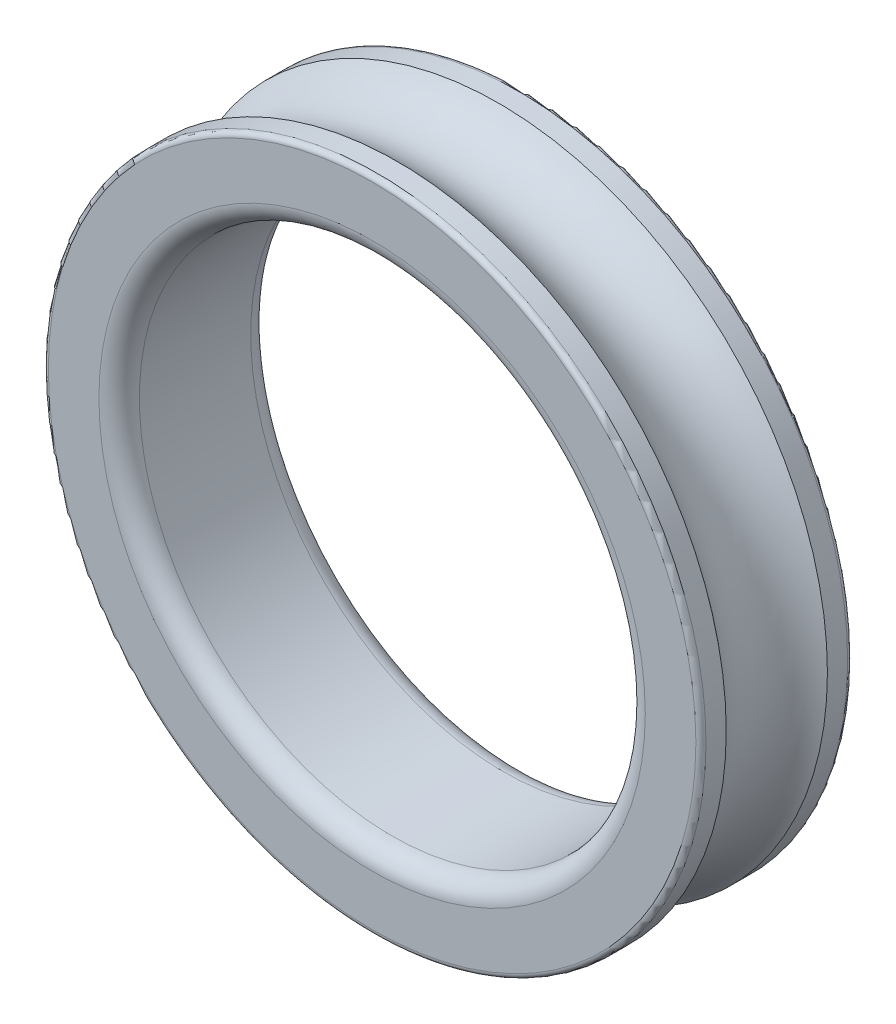
ISO-10303-21;
HEADER;
FILE_DESCRIPTION(('STEP AP214'),'2;1');
FILE_NAME('part.step','',(''),(''),'','','');
FILE_SCHEMA(('AUTOMOTIVE_DESIGN { 1 0 10303 214 1 1 1 1 }'));
ENDSEC;
DATA;
#1=APPLICATION_CONTEXT('core data for automotive mechanical design processes');
#2=APPLICATION_PROTOCOL_DEFINITION('international standard','automotive_design',2000,#1);
#3=PRODUCT_CONTEXT('',#1,'mechanical');
#4=PRODUCT('Part','Part','',(#3));
#5=PRODUCT_RELATED_PRODUCT_CATEGORY('part','',(#4));
#6=PRODUCT_DEFINITION_FORMATION('','',#4);
#7=PRODUCT_DEFINITION_CONTEXT('part definition',#1,'design');
#8=PRODUCT_DEFINITION('design','',#6,#7);
#9=PRODUCT_DEFINITION_SHAPE('','',#8);
#10=(LENGTH_UNIT() NAMED_UNIT(*) SI_UNIT(.MILLI.,.METRE.));
#11=(NAMED_UNIT(*) PLANE_ANGLE_UNIT() SI_UNIT($,.RADIAN.));
#12=(NAMED_UNIT(*) SI_UNIT($,.STERADIAN.) SOLID_ANGLE_UNIT());
#13=UNCERTAINTY_MEASURE_WITH_UNIT(LENGTH_MEASURE(1.E-05),#10,'distance_accuracy_value','');
#14=(GEOMETRIC_REPRESENTATION_CONTEXT(3) GLOBAL_UNCERTAINTY_ASSIGNED_CONTEXT((#13)) GLOBAL_UNIT_ASSIGNED_CONTEXT((#10,
#11,#12)) REPRESENTATION_CONTEXT('',''));
#15=CARTESIAN_POINT('',(0.,0.,0.));
#16=DIRECTION('',(0.,0.,1.));
#17=DIRECTION('',(1.,0.,0.));
#18=AXIS2_PLACEMENT_3D('',#15,#16,#17);
#19=CARTESIAN_POINT('',(0.,0.,6.));
#20=DIRECTION('',(0.,0.,-1.));
#21=DIRECTION('',(-1.,0.,0.));
#22=AXIS2_PLACEMENT_3D('',#19,#20,#21);
#23=CYLINDRICAL_SURFACE('',#22,13.);
#24=CARTESIAN_POINT('',(0.,0.,5.8));
#25=DIRECTION('',(0.,0.,1.));
#26=DIRECTION('',(1.,0.,0.));
#27=AXIS2_PLACEMENT_3D('',#24,#25,#26);
#28=CIRCLE('',#27,13.);
#29=CARTESIAN_POINT('',(13.,0.,5.8));
#30=VERTEX_POINT('',#29);
#31=EDGE_CURVE('E37',#30,#30,#28,.F.);
#32=ORIENTED_EDGE('',*,*,#31,.T.);
#33=EDGE_LOOP('',(#32));
#34=FACE_BOUND('',#33,.T.);
#35=CARTESIAN_POINT('',(0.,0.,5.));
#36=DIRECTION('',(0.,0.,-1.));
#37=DIRECTION('',(-1.,0.,0.));
#38=AXIS2_PLACEMENT_3D('',#35,#36,#37);
#39=CIRCLE('',#38,13.);
#40=CARTESIAN_POINT('',(-13.,0.,5.));
#41=VERTEX_POINT('',#40);
#42=EDGE_CURVE('E82',#41,#41,#39,.T.);
#43=ORIENTED_EDGE('',*,*,#42,.F.);
#44=EDGE_LOOP('',(#43));
#45=FACE_BOUND('',#44,.T.);
#46=ADVANCED_FACE('F50',(#34,#45),#23,.T.);
#47=CARTESIAN_POINT('',(0.,0.,0.2));
#48=DIRECTION('',(0.,0.,1.));
#49=DIRECTION('',(1.,0.,0.));
#50=AXIS2_PLACEMENT_3D('',#47,#48,#49);
#51=CIRCLE('',#50,13.);
#52=CARTESIAN_POINT('',(13.,0.,0.2));
#53=VERTEX_POINT('',#52);
#54=EDGE_CURVE('E65',#53,#53,#51,.T.);
#55=ORIENTED_EDGE('',*,*,#54,.T.);
#56=EDGE_LOOP('',(#55));
#57=FACE_BOUND('',#56,.T.);
#58=CARTESIAN_POINT('',(0.,0.,1.));
#59=DIRECTION('',(0.,0.,1.));
#60=DIRECTION('',(1.,0.,0.));
#61=AXIS2_PLACEMENT_3D('',#58,#59,#60);
#62=CIRCLE('',#61,13.);
#63=CARTESIAN_POINT('',(13.,0.,1.));
#64=VERTEX_POINT('',#63);
#65=EDGE_CURVE('E85',#64,#64,#62,.T.);
#66=ORIENTED_EDGE('',*,*,#65,.F.);
#67=EDGE_LOOP('',(#66));
#68=FACE_BOUND('',#67,.T.);
#69=ADVANCED_FACE('F92',(#57,#68),#23,.T.);
#70=CARTESIAN_POINT('',(0.,0.,6.));
#71=DIRECTION('',(0.,0.,1.));
#72=DIRECTION('',(1.,0.,0.));
#73=AXIS2_PLACEMENT_3D('',#70,#71,#72);
#74=PLANE('',#73);
#75=CARTESIAN_POINT('',(0.,0.,6.));
#76=DIRECTION('',(0.,0.,1.));
#77=DIRECTION('',(1.,0.,0.));
#78=AXIS2_PLACEMENT_3D('',#75,#76,#77);
#79=CIRCLE('',#78,12.8);
#80=CARTESIAN_POINT('',(12.8,0.,6.));
#81=VERTEX_POINT('',#80);
#82=EDGE_CURVE('E57',#81,#81,#79,.T.);
#83=ORIENTED_EDGE('',*,*,#82,.T.);
#84=EDGE_LOOP('',(#83));
#85=FACE_BOUND('',#84,.T.);
#86=CARTESIAN_POINT('',(0.,0.,6.));
#87=DIRECTION('',(0.,0.,1.));
#88=DIRECTION('',(1.,0.,0.));
#89=AXIS2_PLACEMENT_3D('',#86,#87,#88);
#90=CIRCLE('',#89,10.8);
#91=CARTESIAN_POINT('',(10.8,0.,6.));
#92=VERTEX_POINT('',#91);
#93=EDGE_CURVE('E73',#92,#92,#90,.F.);
#94=ORIENTED_EDGE('',*,*,#93,.T.);
#95=EDGE_LOOP('',(#94));
#96=FACE_BOUND('',#95,.T.);
#97=ADVANCED_FACE('F94',(#85,#96),#74,.T.);
#98=CARTESIAN_POINT('',(0.,0.,0.));
#99=DIRECTION('',(0.,0.,1.));
#100=DIRECTION('',(1.,0.,0.));
#101=AXIS2_PLACEMENT_3D('',#98,#99,#100);
#102=PLANE('',#101);
#103=CARTESIAN_POINT('',(0.,0.,0.));
#104=DIRECTION('',(0.,0.,1.));
#105=DIRECTION('',(1.,0.,0.));
#106=AXIS2_PLACEMENT_3D('',#103,#104,#105);
#107=CIRCLE('',#106,12.8);
#108=CARTESIAN_POINT('',(12.8,0.,0.));
#109=VERTEX_POINT('',#108);
#110=EDGE_CURVE('E61',#109,#109,#107,.F.);
#111=ORIENTED_EDGE('',*,*,#110,.T.);
#112=EDGE_LOOP('',(#111));
#113=FACE_BOUND('',#112,.T.);
#114=CARTESIAN_POINT('',(0.,0.,0.));
#115=DIRECTION('',(0.,0.,1.));
#116=DIRECTION('',(1.,0.,0.));
#117=AXIS2_PLACEMENT_3D('',#114,#115,#116);
#118=CIRCLE('',#117,10.8);
#119=CARTESIAN_POINT('',(10.8,0.,0.));
#120=VERTEX_POINT('',#119);
#121=EDGE_CURVE('E70',#120,#120,#118,.T.);
#122=ORIENTED_EDGE('',*,*,#121,.T.);
#123=EDGE_LOOP('',(#122));
#124=FACE_BOUND('',#123,.T.);
#125=ADVANCED_FACE('F101',(#113,#124),#102,.F.);
#126=CARTESIAN_POINT('',(0.,0.,6.));
#127=DIRECTION('',(0.,0.,-1.));
#128=DIRECTION('',(-1.,0.,0.));
#129=AXIS2_PLACEMENT_3D('',#126,#127,#128);
#130=CYLINDRICAL_SURFACE('',#129,10.);
#131=CARTESIAN_POINT('',(0.,0.,5.2));
#132=DIRECTION('',(0.,0.,1.));
#133=DIRECTION('',(1.,0.,0.));
#134=AXIS2_PLACEMENT_3D('',#131,#132,#133);
#135=CIRCLE('',#134,10.);
#136=CARTESIAN_POINT('',(10.,0.,5.2));
#137=VERTEX_POINT('',#136);
#138=EDGE_CURVE('E76',#137,#137,#135,.T.);
#139=ORIENTED_EDGE('',*,*,#138,.T.);
#140=EDGE_LOOP('',(#139));
#141=FACE_BOUND('',#140,.T.);
#142=CARTESIAN_POINT('',(0.,0.,0.8));
#143=DIRECTION('',(0.,0.,1.));
#144=DIRECTION('',(1.,0.,0.));
#145=AXIS2_PLACEMENT_3D('',#142,#143,#144);
#146=CIRCLE('',#145,10.);
#147=CARTESIAN_POINT('',(10.,0.,0.8));
#148=VERTEX_POINT('',#147);
#149=EDGE_CURVE('E79',#148,#148,#146,.F.);
#150=ORIENTED_EDGE('',*,*,#149,.T.);
#151=EDGE_LOOP('',(#150));
#152=FACE_BOUND('',#151,.T.);
#153=ADVANCED_FACE('F125',(#141,#152),#130,.F.);
#154=CARTESIAN_POINT('',(0.,0.,3.));
#155=DIRECTION('',(0.,0.,1.));
#156=DIRECTION('',(1.,0.,0.));
#157=AXIS2_PLACEMENT_3D('',#154,#155,#156);
#158=TOROIDAL_SURFACE('',#157,14.5,2.5);
#159=ORIENTED_EDGE('',*,*,#65,.T.);
#160=EDGE_LOOP('',(#159));
#161=FACE_BOUND('',#160,.T.);
#162=ORIENTED_EDGE('',*,*,#42,.T.);
#163=EDGE_LOOP('',(#162));
#164=FACE_BOUND('',#163,.T.);
#165=ADVANCED_FACE('F89',(#161,#164),#158,.F.);
#166=CARTESIAN_POINT('',(0.,0.,5.2));
#167=DIRECTION('',(0.,0.,1.));
#168=DIRECTION('',(1.,0.,0.));
#169=AXIS2_PLACEMENT_3D('',#166,#167,#168);
#170=TOROIDAL_SURFACE('',#169,10.8,0.8);
#171=ORIENTED_EDGE('',*,*,#93,.F.);
#172=EDGE_LOOP('',(#171));
#173=FACE_BOUND('',#172,.T.);
#174=ORIENTED_EDGE('',*,*,#138,.F.);
#175=EDGE_LOOP('',(#174));
#176=FACE_BOUND('',#175,.T.);
#177=ADVANCED_FACE('F105',(#173,#176),#170,.T.);
#178=CARTESIAN_POINT('',(0.,0.,0.8));
#179=DIRECTION('',(0.,0.,1.));
#180=DIRECTION('',(1.,0.,0.));
#181=AXIS2_PLACEMENT_3D('',#178,#179,#180);
#182=TOROIDAL_SURFACE('',#181,10.8,0.8);
#183=ORIENTED_EDGE('',*,*,#149,.F.);
#184=EDGE_LOOP('',(#183));
#185=FACE_BOUND('',#184,.T.);
#186=ORIENTED_EDGE('',*,*,#121,.F.);
#187=EDGE_LOOP('',(#186));
#188=FACE_BOUND('',#187,.T.);
#189=ADVANCED_FACE('F108',(#185,#188),#182,.T.);
#190=CARTESIAN_POINT('',(0.,0.,0.2));
#191=DIRECTION('',(0.,0.,1.));
#192=DIRECTION('',(1.,0.,0.));
#193=AXIS2_PLACEMENT_3D('',#190,#191,#192);
#194=TOROIDAL_SURFACE('',#193,12.8,0.2);
#195=ORIENTED_EDGE('',*,*,#110,.F.);
#196=EDGE_LOOP('',(#195));
#197=FACE_BOUND('',#196,.T.);
#198=ORIENTED_EDGE('',*,*,#54,.F.);
#199=EDGE_LOOP('',(#198));
#200=FACE_BOUND('',#199,.T.);
#201=ADVANCED_FACE('F111',(#197,#200),#194,.T.);
#202=CARTESIAN_POINT('',(0.,0.,5.8));
#203=DIRECTION('',(0.,0.,1.));
#204=DIRECTION('',(1.,0.,0.));
#205=AXIS2_PLACEMENT_3D('',#202,#203,#204);
#206=TOROIDAL_SURFACE('',#205,12.8,0.2);
#207=ORIENTED_EDGE('',*,*,#31,.F.);
#208=EDGE_LOOP('',(#207));
#209=FACE_BOUND('',#208,.T.);
#210=ORIENTED_EDGE('',*,*,#82,.F.);
#211=EDGE_LOOP('',(#210));
#212=FACE_BOUND('',#211,.T.);
#213=ADVANCED_FACE('F52',(#209,#212),#206,.T.);
#214=CLOSED_SHELL('',(#46,#69,#97,#125,#153,#165,#177,#189,#201,#213));
#215=MANIFOLD_SOLID_BREP('B6',#214);
#216=ADVANCED_BREP_SHAPE_REPRESENTATION('',(#18,#215),#14);
#217=SHAPE_DEFINITION_REPRESENTATION(#9,#216);
ENDSEC;
END-ISO-10303-21;
